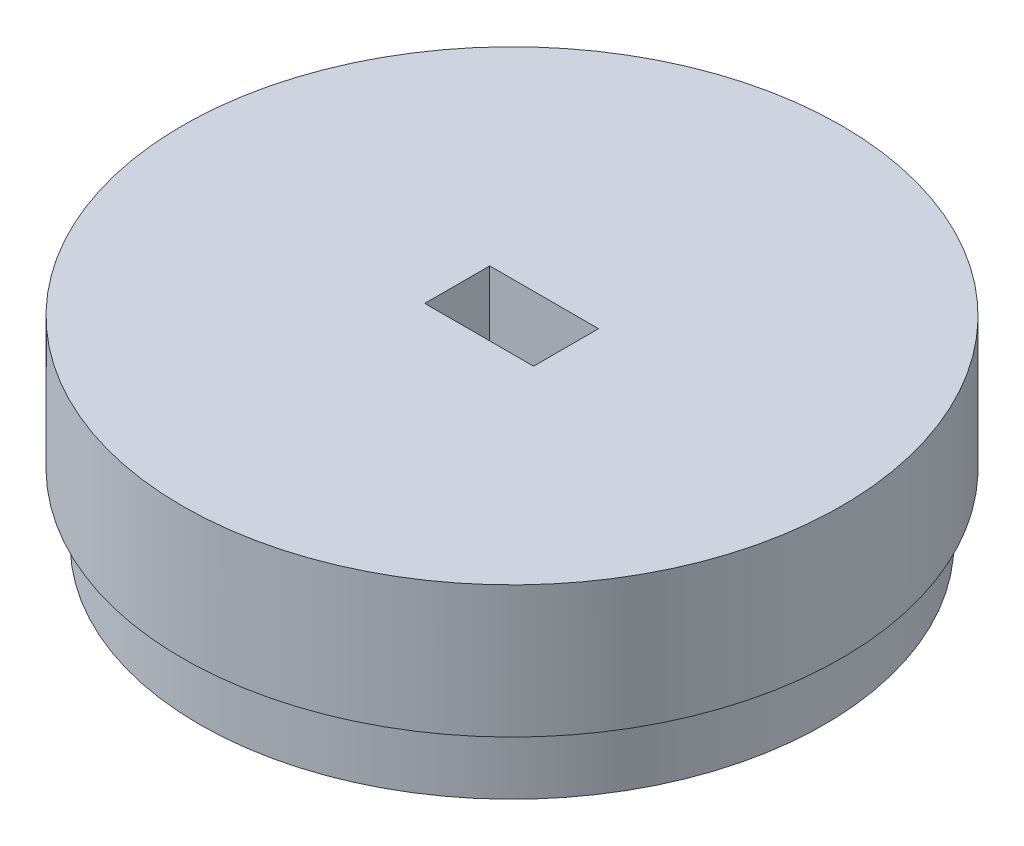
ISO-10303-21;
HEADER;
FILE_DESCRIPTION(('STEP AP214'),'2;1');
FILE_NAME('part.step','',(''),(''),'','','');
FILE_SCHEMA(('AUTOMOTIVE_DESIGN { 1 0 10303 214 1 1 1 1 }'));
ENDSEC;
DATA;
#1=APPLICATION_CONTEXT('core data for automotive mechanical design processes');
#2=APPLICATION_PROTOCOL_DEFINITION('international standard','automotive_design',2000,#1);
#3=PRODUCT_CONTEXT('',#1,'mechanical');
#4=PRODUCT('Part','Part','',(#3));
#5=PRODUCT_RELATED_PRODUCT_CATEGORY('part','',(#4));
#6=PRODUCT_DEFINITION_FORMATION('','',#4);
#7=PRODUCT_DEFINITION_CONTEXT('part definition',#1,'design');
#8=PRODUCT_DEFINITION('design','',#6,#7);
#9=PRODUCT_DEFINITION_SHAPE('','',#8);
#10=(LENGTH_UNIT() NAMED_UNIT(*) SI_UNIT(.MILLI.,.METRE.));
#11=(NAMED_UNIT(*) PLANE_ANGLE_UNIT() SI_UNIT($,.RADIAN.));
#12=(NAMED_UNIT(*) SI_UNIT($,.STERADIAN.) SOLID_ANGLE_UNIT());
#13=UNCERTAINTY_MEASURE_WITH_UNIT(LENGTH_MEASURE(1.E-05),#10,'distance_accuracy_value','');
#14=(GEOMETRIC_REPRESENTATION_CONTEXT(3) GLOBAL_UNCERTAINTY_ASSIGNED_CONTEXT((#13)) GLOBAL_UNIT_ASSIGNED_CONTEXT((#10,
#11,#12)) REPRESENTATION_CONTEXT('',''));
#15=CARTESIAN_POINT('',(0.,0.,0.));
#16=DIRECTION('',(0.,0.,1.));
#17=DIRECTION('',(1.,0.,0.));
#18=AXIS2_PLACEMENT_3D('',#15,#16,#17);
#19=CARTESIAN_POINT('',(0.,8.99999999999997,0.));
#20=DIRECTION('',(0.,-1.,0.));
#21=DIRECTION('',(0.,0.,-1.));
#22=AXIS2_PLACEMENT_3D('',#19,#20,#21);
#23=CYLINDRICAL_SURFACE('',#22,15.);
#24=CARTESIAN_POINT('',(0.,8.99999999999997,0.));
#25=DIRECTION('',(0.,1.,0.));
#26=DIRECTION('',(0.,0.,1.));
#27=AXIS2_PLACEMENT_3D('',#24,#25,#26);
#28=CIRCLE('',#27,15.);
#29=CARTESIAN_POINT('',(0.,8.99999999999997,15.));
#30=VERTEX_POINT('',#29);
#31=EDGE_CURVE('E13',#30,#30,#28,.T.);
#32=ORIENTED_EDGE('',*,*,#31,.F.);
#33=EDGE_LOOP('',(#32));
#34=FACE_BOUND('',#33,.T.);
#35=CARTESIAN_POINT('',(0.,3.,0.));
#36=DIRECTION('',(0.,-1.,0.));
#37=DIRECTION('',(0.,0.,-1.));
#38=AXIS2_PLACEMENT_3D('',#35,#36,#37);
#39=CIRCLE('',#38,15.);
#40=CARTESIAN_POINT('',(0.,3.,-15.));
#41=VERTEX_POINT('',#40);
#42=EDGE_CURVE('E62',#41,#41,#39,.T.);
#43=ORIENTED_EDGE('',*,*,#42,.F.);
#44=EDGE_LOOP('',(#43));
#45=FACE_BOUND('',#44,.T.);
#46=ADVANCED_FACE('F59',(#34,#45),#23,.T.);
#47=CARTESIAN_POINT('',(0.,8.99999999999997,0.));
#48=DIRECTION('',(0.,1.,0.));
#49=DIRECTION('',(0.,0.,1.));
#50=AXIS2_PLACEMENT_3D('',#47,#48,#49);
#51=PLANE('',#50);
#52=DIRECTION('',(0.,0.,-1.));
#53=VECTOR('',#52,1.);
#54=CARTESIAN_POINT('',(2.47625341836926,8.99999999999997,1.49583255612883));
#55=LINE('',#54,#53);
#56=CARTESIAN_POINT('',(2.47625341836926,8.99999999999997,1.49583255612883));
#57=VERTEX_POINT('',#56);
#58=CARTESIAN_POINT('',(2.47625341836926,8.99999999999997,-1.4611192376458));
#59=VERTEX_POINT('',#58);
#60=EDGE_CURVE('E74',#57,#59,#55,.T.);
#61=ORIENTED_EDGE('',*,*,#60,.F.);
#62=DIRECTION('',(1.,0.,0.));
#63=VECTOR('',#62,1.);
#64=CARTESIAN_POINT('',(2.47625341836926,8.99999999999997,1.49583255612883));
#65=LINE('',#64,#63);
#66=CARTESIAN_POINT('',(-2.47625341836926,8.99999999999997,1.49583255612883));
#67=VERTEX_POINT('',#66);
#68=EDGE_CURVE('E129',#67,#57,#65,.T.);
#69=ORIENTED_EDGE('',*,*,#68,.F.);
#70=DIRECTION('',(0.,0.,1.));
#71=VECTOR('',#70,1.);
#72=CARTESIAN_POINT('',(-2.47625341836926,8.99999999999997,1.49583255612883));
#73=LINE('',#72,#71);
#74=CARTESIAN_POINT('',(-2.47625341836926,8.99999999999997,-1.4611192376458));
#75=VERTEX_POINT('',#74);
#76=EDGE_CURVE('E138',#75,#67,#73,.T.);
#77=ORIENTED_EDGE('',*,*,#76,.F.);
#78=DIRECTION('',(-1.,0.,0.));
#79=VECTOR('',#78,1.);
#80=CARTESIAN_POINT('',(2.47625341836926,8.99999999999997,-1.4611192376458));
#81=LINE('',#80,#79);
#82=EDGE_CURVE('E109',#59,#75,#81,.T.);
#83=ORIENTED_EDGE('',*,*,#82,.F.);
#84=EDGE_LOOP('',(#61,#69,#77,#83));
#85=FACE_BOUND('',#84,.T.);
#86=ORIENTED_EDGE('',*,*,#31,.T.);
#87=EDGE_LOOP('',(#86));
#88=FACE_BOUND('',#87,.T.);
#89=ADVANCED_FACE('F170',(#85,#88),#51,.T.);
#90=CARTESIAN_POINT('',(0.,3.,0.));
#91=DIRECTION('',(0.,-1.,0.));
#92=DIRECTION('',(0.,0.,-1.));
#93=AXIS2_PLACEMENT_3D('',#90,#91,#92);
#94=PLANE('',#93);
#95=CARTESIAN_POINT('',(0.,3.,0.));
#96=DIRECTION('',(0.,-1.,0.));
#97=DIRECTION('',(0.,0.,-1.));
#98=AXIS2_PLACEMENT_3D('',#95,#96,#97);
#99=CIRCLE('',#98,14.2220153833762);
#100=CARTESIAN_POINT('',(0.,3.,-14.2220153833762));
#101=VERTEX_POINT('',#100);
#102=EDGE_CURVE('E150',#101,#101,#99,.T.);
#103=ORIENTED_EDGE('',*,*,#102,.F.);
#104=EDGE_LOOP('',(#103));
#105=FACE_BOUND('',#104,.T.);
#106=ORIENTED_EDGE('',*,*,#42,.T.);
#107=EDGE_LOOP('',(#106));
#108=FACE_BOUND('',#107,.T.);
#109=ADVANCED_FACE('F162',(#105,#108),#94,.T.);
#110=CARTESIAN_POINT('',(0.,3.,0.));
#111=DIRECTION('',(0.,-1.,0.));
#112=DIRECTION('',(0.,0.,-1.));
#113=AXIS2_PLACEMENT_3D('',#110,#111,#112);
#114=CYLINDRICAL_SURFACE('',#113,14.2220153833762);
#115=ORIENTED_EDGE('',*,*,#102,.T.);
#116=EDGE_LOOP('',(#115));
#117=FACE_BOUND('',#116,.T.);
#118=CARTESIAN_POINT('',(0.,0.,0.));
#119=DIRECTION('',(0.,-1.,0.));
#120=DIRECTION('',(0.,0.,-1.));
#121=AXIS2_PLACEMENT_3D('',#118,#119,#120);
#122=CIRCLE('',#121,14.2220153833762);
#123=CARTESIAN_POINT('',(0.,0.,-14.2220153833762));
#124=VERTEX_POINT('',#123);
#125=EDGE_CURVE('E145',#124,#124,#122,.T.);
#126=ORIENTED_EDGE('',*,*,#125,.F.);
#127=EDGE_LOOP('',(#126));
#128=FACE_BOUND('',#127,.T.);
#129=ADVANCED_FACE('F160',(#117,#128),#114,.T.);
#130=CARTESIAN_POINT('',(0.,0.,0.));
#131=DIRECTION('',(0.,1.,0.));
#132=DIRECTION('',(0.,0.,1.));
#133=AXIS2_PLACEMENT_3D('',#130,#131,#132);
#134=PLANE('',#133);
#135=ORIENTED_EDGE('',*,*,#125,.T.);
#136=EDGE_LOOP('',(#135));
#137=FACE_BOUND('',#136,.T.);
#138=ADVANCED_FACE('F158',(#137),#134,.F.);
#139=CARTESIAN_POINT('',(2.47625341836926,2.99999999999997,1.49583255612883));
#140=DIRECTION('',(1.,0.,0.));
#141=DIRECTION('',(0.,0.,-1.));
#142=AXIS2_PLACEMENT_3D('',#139,#140,#141);
#143=PLANE('',#142);
#144=ORIENTED_EDGE('',*,*,#60,.T.);
#145=DIRECTION('',(0.,1.,0.));
#146=VECTOR('',#145,1.);
#147=CARTESIAN_POINT('',(2.47625341836926,2.99999999999997,-1.4611192376458));
#148=LINE('',#147,#146);
#149=CARTESIAN_POINT('',(2.47625341836926,2.99999999999997,-1.4611192376458));
#150=VERTEX_POINT('',#149);
#151=EDGE_CURVE('E97',#150,#59,#148,.T.);
#152=ORIENTED_EDGE('',*,*,#151,.F.);
#153=DIRECTION('',(0.,0.,-1.));
#154=VECTOR('',#153,1.);
#155=CARTESIAN_POINT('',(2.47625341836926,2.99999999999997,1.49583255612883));
#156=LINE('',#155,#154);
#157=CARTESIAN_POINT('',(2.47625341836926,2.99999999999997,1.49583255612883));
#158=VERTEX_POINT('',#157);
#159=EDGE_CURVE('E125',#158,#150,#156,.T.);
#160=ORIENTED_EDGE('',*,*,#159,.F.);
#161=DIRECTION('',(0.,1.,0.));
#162=VECTOR('',#161,1.);
#163=CARTESIAN_POINT('',(2.47625341836926,2.99999999999997,1.49583255612883));
#164=LINE('',#163,#162);
#165=EDGE_CURVE('E82',#158,#57,#164,.T.);
#166=ORIENTED_EDGE('',*,*,#165,.T.);
#167=EDGE_LOOP('',(#144,#152,#160,#166));
#168=FACE_BOUND('',#167,.T.);
#169=ADVANCED_FACE('F169',(#168),#143,.F.);
#170=CARTESIAN_POINT('',(2.47625341836926,2.99999999999997,1.49583255612883));
#171=DIRECTION('',(0.,0.,1.));
#172=DIRECTION('',(1.,0.,0.));
#173=AXIS2_PLACEMENT_3D('',#170,#171,#172);
#174=PLANE('',#173);
#175=ORIENTED_EDGE('',*,*,#68,.T.);
#176=ORIENTED_EDGE('',*,*,#165,.F.);
#177=DIRECTION('',(1.,0.,0.));
#178=VECTOR('',#177,1.);
#179=CARTESIAN_POINT('',(2.47625341836926,2.99999999999997,1.49583255612883));
#180=LINE('',#179,#178);
#181=CARTESIAN_POINT('',(-2.47625341836926,2.99999999999997,1.49583255612883));
#182=VERTEX_POINT('',#181);
#183=EDGE_CURVE('E122',#182,#158,#180,.T.);
#184=ORIENTED_EDGE('',*,*,#183,.F.);
#185=DIRECTION('',(0.,1.,0.));
#186=VECTOR('',#185,1.);
#187=CARTESIAN_POINT('',(-2.47625341836926,2.99999999999997,1.49583255612883));
#188=LINE('',#187,#186);
#189=EDGE_CURVE('E114',#182,#67,#188,.T.);
#190=ORIENTED_EDGE('',*,*,#189,.T.);
#191=EDGE_LOOP('',(#175,#176,#184,#190));
#192=FACE_BOUND('',#191,.T.);
#193=ADVANCED_FACE('F191',(#192),#174,.F.);
#194=CARTESIAN_POINT('',(-2.47625341836926,2.99999999999997,1.49583255612883));
#195=DIRECTION('',(-1.,0.,0.));
#196=DIRECTION('',(0.,0.,1.));
#197=AXIS2_PLACEMENT_3D('',#194,#195,#196);
#198=PLANE('',#197);
#199=ORIENTED_EDGE('',*,*,#76,.T.);
#200=ORIENTED_EDGE('',*,*,#189,.F.);
#201=DIRECTION('',(0.,0.,1.));
#202=VECTOR('',#201,1.);
#203=CARTESIAN_POINT('',(-2.47625341836926,2.99999999999997,1.49583255612883));
#204=LINE('',#203,#202);
#205=CARTESIAN_POINT('',(-2.47625341836926,2.99999999999997,-1.4611192376458));
#206=VERTEX_POINT('',#205);
#207=EDGE_CURVE('E117',#206,#182,#204,.T.);
#208=ORIENTED_EDGE('',*,*,#207,.F.);
#209=DIRECTION('',(0.,1.,0.));
#210=VECTOR('',#209,1.);
#211=CARTESIAN_POINT('',(-2.47625341836926,2.99999999999997,-1.4611192376458));
#212=LINE('',#211,#210);
#213=EDGE_CURVE('E102',#206,#75,#212,.T.);
#214=ORIENTED_EDGE('',*,*,#213,.T.);
#215=EDGE_LOOP('',(#199,#200,#208,#214));
#216=FACE_BOUND('',#215,.T.);
#217=ADVANCED_FACE('F118',(#216),#198,.F.);
#218=CARTESIAN_POINT('',(2.47625341836926,2.99999999999997,-1.4611192376458));
#219=DIRECTION('',(0.,0.,-1.));
#220=DIRECTION('',(-1.,0.,0.));
#221=AXIS2_PLACEMENT_3D('',#218,#219,#220);
#222=PLANE('',#221);
#223=ORIENTED_EDGE('',*,*,#82,.T.);
#224=ORIENTED_EDGE('',*,*,#213,.F.);
#225=DIRECTION('',(-1.,0.,0.));
#226=VECTOR('',#225,1.);
#227=CARTESIAN_POINT('',(2.47625341836926,2.99999999999997,-1.4611192376458));
#228=LINE('',#227,#226);
#229=EDGE_CURVE('E106',#150,#206,#228,.T.);
#230=ORIENTED_EDGE('',*,*,#229,.F.);
#231=ORIENTED_EDGE('',*,*,#151,.T.);
#232=EDGE_LOOP('',(#223,#224,#230,#231));
#233=FACE_BOUND('',#232,.T.);
#234=ADVANCED_FACE('F104',(#233),#222,.F.);
#235=CARTESIAN_POINT('',(0.,2.99999999999997,0.));
#236=DIRECTION('',(0.,1.,0.));
#237=DIRECTION('',(0.,0.,1.));
#238=AXIS2_PLACEMENT_3D('',#235,#236,#237);
#239=PLANE('',#238);
#240=ORIENTED_EDGE('',*,*,#159,.T.);
#241=ORIENTED_EDGE('',*,*,#229,.T.);
#242=ORIENTED_EDGE('',*,*,#207,.T.);
#243=ORIENTED_EDGE('',*,*,#183,.T.);
#244=EDGE_LOOP('',(#240,#241,#242,#243));
#245=FACE_BOUND('',#244,.T.);
#246=ADVANCED_FACE('F124',(#245),#239,.T.);
#247=CLOSED_SHELL('',(#46,#89,#109,#129,#138,#169,#193,#217,#234,#246));
#248=MANIFOLD_SOLID_BREP('B2',#247);
#249=ADVANCED_BREP_SHAPE_REPRESENTATION('',(#18,#248),#14);
#250=SHAPE_DEFINITION_REPRESENTATION(#9,#249);
ENDSEC;
END-ISO-10303-21;
